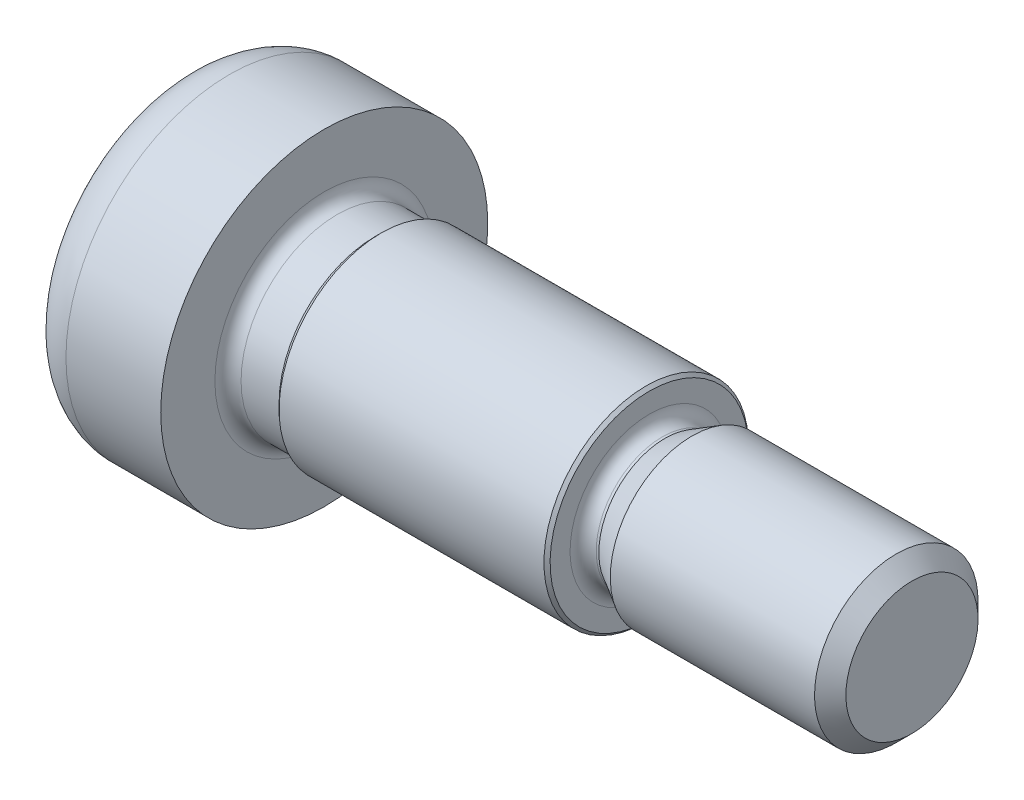
ISO-10303-21;
HEADER;
FILE_DESCRIPTION(('STEP AP214'),'2;1');
FILE_NAME('part.step','',(''),(''),'','','');
FILE_SCHEMA(('AUTOMOTIVE_DESIGN { 1 0 10303 214 1 1 1 1 }'));
ENDSEC;
DATA;
#1=APPLICATION_CONTEXT('core data for automotive mechanical design processes');
#2=APPLICATION_PROTOCOL_DEFINITION('international standard','automotive_design',2000,#1);
#3=PRODUCT_CONTEXT('',#1,'mechanical');
#4=PRODUCT('Part','Part','',(#3));
#5=PRODUCT_RELATED_PRODUCT_CATEGORY('part','',(#4));
#6=PRODUCT_DEFINITION_FORMATION('','',#4);
#7=PRODUCT_DEFINITION_CONTEXT('part definition',#1,'design');
#8=PRODUCT_DEFINITION('design','',#6,#7);
#9=PRODUCT_DEFINITION_SHAPE('','',#8);
#10=(LENGTH_UNIT() NAMED_UNIT(*) SI_UNIT(.MILLI.,.METRE.));
#11=(NAMED_UNIT(*) PLANE_ANGLE_UNIT() SI_UNIT($,.RADIAN.));
#12=(NAMED_UNIT(*) SI_UNIT($,.STERADIAN.) SOLID_ANGLE_UNIT());
#13=UNCERTAINTY_MEASURE_WITH_UNIT(LENGTH_MEASURE(1.E-05),#10,'distance_accuracy_value','');
#14=(GEOMETRIC_REPRESENTATION_CONTEXT(3) GLOBAL_UNCERTAINTY_ASSIGNED_CONTEXT((#13)) GLOBAL_UNIT_ASSIGNED_CONTEXT((#10,
#11,#12)) REPRESENTATION_CONTEXT('',''));
#15=CARTESIAN_POINT('',(0.,0.,0.));
#16=DIRECTION('',(0.,0.,1.));
#17=DIRECTION('',(1.,0.,0.));
#18=AXIS2_PLACEMENT_3D('',#15,#16,#17);
#19=CARTESIAN_POINT('',(-2.80999999989717,0.,0.));
#20=DIRECTION('',(-1.,0.,0.));
#21=DIRECTION('',(0.,0.,1.));
#22=AXIS2_PLACEMENT_3D('',#19,#20,#21);
#23=CONICAL_SURFACE('',#22,2.9040718539477,1.04719755119609);
#24=CARTESIAN_POINT('',(-1.13333333331411,1.13686837721616E-10,0.));
#25=VERTEX_POINT('',#24);
#26=VERTEX_LOOP('',#25);
#27=FACE_BOUND('',#26,.T.);
#28=CARTESIAN_POINT('',(-2.79999999995221,1.44337567298786,-2.49999999998912));
#29=CARTESIAN_POINT('',(-2.76336943135569,1.31652043413049,-2.49999999999609));
#30=CARTESIAN_POINT('',(-2.73005584632032,1.18857018265532,-2.49999999999895));
#31=CARTESIAN_POINT('',(-2.67190798419303,0.930454306688463,-2.50000000000105));
#32=CARTESIAN_POINT('',(-2.6470942753653,0.800284097470101,-2.50000000000028));
#33=CARTESIAN_POINT('',(-2.60846994862478,0.541556813183558,-2.49999999999973));
#34=CARTESIAN_POINT('',(-2.59440223443783,0.413039535473005,-2.49999999999993));
#35=CARTESIAN_POINT('',(-2.57761146010408,0.155400579290812,-2.50000000000007));
#36=CARTESIAN_POINT('',(-2.57487449240858,0.0262798366241759,-2.50000000000002));
#37=CARTESIAN_POINT('',(-2.5805828626341,-0.214968419309952,-2.49999999999998));
#38=CARTESIAN_POINT('',(-2.58762660646096,-0.32713213384364,-2.49999999999999));
#39=CARTESIAN_POINT('',(-2.60994662583864,-0.550728852897912,-2.5));
#40=CARTESIAN_POINT('',(-2.62523051840205,-0.662161084634378,-2.5));
#41=CARTESIAN_POINT('',(-2.66343729161492,-0.886218434016785,-2.5));
#42=CARTESIAN_POINT('',(-2.68652205271541,-0.998815208486799,-2.5));
#43=CARTESIAN_POINT('',(-2.73891470099291,-1.22232986225294,-2.5));
#44=CARTESIAN_POINT('',(-2.76821028588466,-1.33325060282122,-2.5));
#45=CARTESIAN_POINT('',(-2.79999999994514,-1.44337567298802,-2.5));
#46=B_SPLINE_CURVE_WITH_KNOTS('',3,(#28,#29,#30,#31,#32,#33,#34,#35,#36,#37,#38,#39,#40,#41,#42,
#43,#44,#45),.UNSPECIFIED.,.F.,.F.,(4,2,2,2,2,2,2,2,4),(0.,0.396270014449122,0.793492271289814,
1.18088450769943,1.56780111113299,1.90463472830536,2.24178024226325,2.58640202813631,
2.93034746692445),.UNSPECIFIED.);
#47=CARTESIAN_POINT('',(-2.79999999994564,1.44337567297799,-2.5000000000068));
#48=VERTEX_POINT('',#47);
#49=CARTESIAN_POINT('',(-2.79999999994564,-1.44337567297798,-2.50000000000679));
#50=VERTEX_POINT('',#49);
#51=EDGE_CURVE('E106',#48,#50,#46,.T.);
#52=ORIENTED_EDGE('',*,*,#51,.T.);
#53=CARTESIAN_POINT('',(-2.79999999995222,-1.44337567295774,-2.5000000000065));
#54=CARTESIAN_POINT('',(-2.76336943135569,-1.50680329239246,-2.39014014055637));
#55=CARTESIAN_POINT('',(-2.73005584632032,-1.57077841813252,-2.27933197235969));
#56=CARTESIAN_POINT('',(-2.67190798419303,-1.69983635611777,-2.05579706665337));
#57=CARTESIAN_POINT('',(-2.64709427536529,-1.76492146072628,-1.94306635865395));
#58=CARTESIAN_POINT('',(-2.60846994862478,-1.89428510286908,-1.71900195780937));
#59=CARTESIAN_POINT('',(-2.59440223443783,-1.95854374172453,-1.60770273048691));
#60=CARTESIAN_POINT('',(-2.57761146010408,-2.08736321981575,-1.3845808494287));
#61=CARTESIAN_POINT('',(-2.57487449240858,-2.15192359114902,-1.27275900612385));
#62=CARTESIAN_POINT('',(-2.5805828626341,-2.27254771911605,-1.06383188786619));
#63=CARTESIAN_POINT('',(-2.58762660646095,-2.32862957638291,-0.966695261697194));
#64=CARTESIAN_POINT('',(-2.60994662583863,-2.44042793591005,-0.773054822793345));
#65=CARTESIAN_POINT('',(-2.62523051840205,-2.49614405177828,-0.676551679309169));
#66=CARTESIAN_POINT('',(-2.66343729161492,-2.60817272646949,-0.482512322839397));
#67=CARTESIAN_POINT('',(-2.68652205271541,-2.66447111370449,-0.385000655764178));
#68=CARTESIAN_POINT('',(-2.73891470099291,-2.77622844058757,-0.191431287484617));
#69=CARTESIAN_POINT('',(-2.76821028588466,-2.83168881087171,-0.0953711083458992));
#70=CARTESIAN_POINT('',(-2.79999999994514,-2.88675134595511,1.20937300864769E-11));
#71=B_SPLINE_CURVE_WITH_KNOTS('',3,(#53,#54,#55,#56,#57,#58,#59,#60,#61,#62,#63,#64,#65,#66,#67,
#68,#69,#70),.UNSPECIFIED.,.F.,.F.,(4,2,2,2,2,2,2,2,4),(0.,0.396270014449122,0.793492271289814,
1.18088450769943,1.56780111113299,1.90463472830536,2.24178024226325,2.58640202813632,
2.93034746692446),.UNSPECIFIED.);
#72=CARTESIAN_POINT('',(-2.79999999994564,-2.88675134595597,0.));
#73=VERTEX_POINT('',#72);
#74=EDGE_CURVE('E109',#50,#73,#71,.T.);
#75=ORIENTED_EDGE('',*,*,#74,.T.);
#76=CARTESIAN_POINT('',(-2.79999999995222,-2.8867513459456,-1.73849766311451E-11));
#77=CARTESIAN_POINT('',(-2.76336943135569,-2.82332372652296,0.109859859439725));
#78=CARTESIAN_POINT('',(-2.73005584632032,-2.75934860078785,0.220668027639261));
#79=CARTESIAN_POINT('',(-2.67190798419304,-2.63029066280624,0.444202933347681));
#80=CARTESIAN_POINT('',(-2.6470942753653,-2.56520555819639,0.556933641346332));
#81=CARTESIAN_POINT('',(-2.60846994862479,-2.43584191605264,0.780998042190361));
#82=CARTESIAN_POINT('',(-2.59440223443783,-2.37158327719754,0.89229726951302));
#83=CARTESIAN_POINT('',(-2.57761146010408,-2.24276379910657,1.11541915057138));
#84=CARTESIAN_POINT('',(-2.57487449240858,-2.1782034277732,1.22724099387617));
#85=CARTESIAN_POINT('',(-2.5805828626341,-2.05757929980611,1.4361681121338));
#86=CARTESIAN_POINT('',(-2.58762660646096,-2.00149744253927,1.5333047383028));
#87=CARTESIAN_POINT('',(-2.60994662583864,-1.88969908301214,1.72694517720666));
#88=CARTESIAN_POINT('',(-2.62523051840206,-1.83398296714391,1.82344832069083));
#89=CARTESIAN_POINT('',(-2.66343729161493,-1.7219542924527,2.0174876771606));
#90=CARTESIAN_POINT('',(-2.68652205271541,-1.6656559052177,2.11499934423582));
#91=CARTESIAN_POINT('',(-2.73891470099292,-1.55389857833463,2.30856871251538));
#92=CARTESIAN_POINT('',(-2.76821028588467,-1.49843820805048,2.4046288916541));
#93=CARTESIAN_POINT('',(-2.79999999994514,-1.44337567296708,2.50000000001209));
#94=B_SPLINE_CURVE_WITH_KNOTS('',3,(#76,#77,#78,#79,#80,#81,#82,#83,#84,#85,#86,#87,#88,#89,#90,
#91,#92,#93),.UNSPECIFIED.,.F.,.F.,(4,2,2,2,2,2,2,2,4),(0.,0.396270014449122,0.793492271289814,
1.18088450769944,1.56780111113299,1.90463472830536,2.24178024226325,2.58640202813631,
2.93034746692445),.UNSPECIFIED.);
#95=CARTESIAN_POINT('',(-2.79999999994564,-1.44337567297799,2.5000000000068));
#96=VERTEX_POINT('',#95);
#97=EDGE_CURVE('E136',#73,#96,#94,.T.);
#98=ORIENTED_EDGE('',*,*,#97,.T.);
#99=CARTESIAN_POINT('',(-2.79999999995221,-1.44337567298786,2.49999999998912));
#100=CARTESIAN_POINT('',(-2.76336943135569,-1.31652043413049,2.49999999999609));
#101=CARTESIAN_POINT('',(-2.73005584632032,-1.18857018265532,2.49999999999895));
#102=CARTESIAN_POINT('',(-2.67190798419303,-0.930454306688462,2.50000000000105));
#103=CARTESIAN_POINT('',(-2.6470942753653,-0.8002840974701,2.50000000000028));
#104=CARTESIAN_POINT('',(-2.60846994862478,-0.541556813183558,2.49999999999973));
#105=CARTESIAN_POINT('',(-2.59440223443783,-0.413039535473004,2.49999999999993));
#106=CARTESIAN_POINT('',(-2.57761146010408,-0.155400579290811,2.50000000000007));
#107=CARTESIAN_POINT('',(-2.57487449240858,-0.0262798366241754,2.50000000000002));
#108=CARTESIAN_POINT('',(-2.5805828626341,0.214968419309952,2.49999999999998));
#109=CARTESIAN_POINT('',(-2.58762660646096,0.327132133843641,2.5));
#110=CARTESIAN_POINT('',(-2.60994662583864,0.550728852897913,2.5));
#111=CARTESIAN_POINT('',(-2.62523051840205,0.662161084634379,2.5));
#112=CARTESIAN_POINT('',(-2.66343729161493,0.886218434016785,2.5));
#113=CARTESIAN_POINT('',(-2.68652205271541,0.9988152084868,2.5));
#114=CARTESIAN_POINT('',(-2.73891470099291,1.22232986225294,2.5));
#115=CARTESIAN_POINT('',(-2.76821028588466,1.33325060282122,2.5));
#116=CARTESIAN_POINT('',(-2.79999999994514,1.44337567298802,2.5));
#117=B_SPLINE_CURVE_WITH_KNOTS('',3,(#99,#100,#101,#102,#103,#104,#105,#106,#107,#108,#109,#110,
#111,#112,#113,#114,#115,#116),.UNSPECIFIED.,.F.,.F.,(4,2,2,2,2,2,2,2,4),(0.,0.396270014449122,
0.793492271289814,1.18088450769943,1.56780111113299,1.90463472830536,2.24178024226325,
2.58640202813631,2.93034746692445),.UNSPECIFIED.);
#118=CARTESIAN_POINT('',(-2.79999999994564,1.44337567297798,2.5000000000068));
#119=VERTEX_POINT('',#118);
#120=EDGE_CURVE('E142',#96,#119,#117,.T.);
#121=ORIENTED_EDGE('',*,*,#120,.T.);
#122=CARTESIAN_POINT('',(-2.79999999995221,1.44337567295774,2.5000000000065));
#123=CARTESIAN_POINT('',(-2.76336943135569,1.50680329239246,2.39014014055637));
#124=CARTESIAN_POINT('',(-2.73005584632032,1.57077841813252,2.27933197235969));
#125=CARTESIAN_POINT('',(-2.67190798419303,1.69983635611777,2.05579706665337));
#126=CARTESIAN_POINT('',(-2.64709427536529,1.76492146072628,1.94306635865395));
#127=CARTESIAN_POINT('',(-2.60846994862478,1.89428510286908,1.71900195780937));
#128=CARTESIAN_POINT('',(-2.59440223443783,1.95854374172453,1.60770273048691));
#129=CARTESIAN_POINT('',(-2.57761146010408,2.08736321981575,1.3845808494287));
#130=CARTESIAN_POINT('',(-2.57487449240858,2.15192359114902,1.27275900612385));
#131=CARTESIAN_POINT('',(-2.58058286263409,2.27254771911605,1.06383188786619));
#132=CARTESIAN_POINT('',(-2.58762660646095,2.32862957638291,0.966695261697194));
#133=CARTESIAN_POINT('',(-2.60994662583863,2.44042793591005,0.773054822793345));
#134=CARTESIAN_POINT('',(-2.62523051840205,2.49614405177828,0.676551679309169));
#135=CARTESIAN_POINT('',(-2.66343729161492,2.60817272646949,0.482512322839397));
#136=CARTESIAN_POINT('',(-2.68652205271541,2.66447111370449,0.385000655764177));
#137=CARTESIAN_POINT('',(-2.73891470099291,2.77622844058757,0.191431287484617));
#138=CARTESIAN_POINT('',(-2.76821028588466,2.83168881087171,0.0953711083458985));
#139=CARTESIAN_POINT('',(-2.79999999994514,2.88675134595511,-1.20943108200643E-11));
#140=B_SPLINE_CURVE_WITH_KNOTS('',3,(#122,#123,#124,#125,#126,#127,#128,#129,#130,#131,#132,
#133,#134,#135,#136,#137,#138,#139),.UNSPECIFIED.,.F.,.F.,(4,2,2,2,2,2,2,2,4),(0.,
0.396270014449122,0.793492271289814,1.18088450769943,1.56780111113299,1.90463472830536,
2.24178024226325,2.58640202813632,2.93034746692446),.UNSPECIFIED.);
#141=CARTESIAN_POINT('',(-2.79999999994337,2.88675134595205,-6.79639141308692E-12));
#142=VERTEX_POINT('',#141);
#143=EDGE_CURVE('E94',#119,#142,#140,.T.);
#144=ORIENTED_EDGE('',*,*,#143,.T.);
#145=CARTESIAN_POINT('',(-2.79999999995222,2.8867513459456,1.73856786329555E-11));
#146=CARTESIAN_POINT('',(-2.76336943135569,2.82332372652296,-0.109859859439724));
#147=CARTESIAN_POINT('',(-2.73005584632032,2.75934860078785,-0.22066802763926));
#148=CARTESIAN_POINT('',(-2.67190798419303,2.63029066280624,-0.44420293334768));
#149=CARTESIAN_POINT('',(-2.6470942753653,2.56520555819639,-0.556933641346331));
#150=CARTESIAN_POINT('',(-2.60846994862478,2.43584191605264,-0.780998042190361));
#151=CARTESIAN_POINT('',(-2.59440223443783,2.37158327719754,-0.892297269513019));
#152=CARTESIAN_POINT('',(-2.57761146010408,2.24276379910657,-1.11541915057138));
#153=CARTESIAN_POINT('',(-2.57487449240858,2.1782034277732,-1.22724099387617));
#154=CARTESIAN_POINT('',(-2.5805828626341,2.05757929980611,-1.4361681121338));
#155=CARTESIAN_POINT('',(-2.58762660646096,2.00149744253927,-1.5333047383028));
#156=CARTESIAN_POINT('',(-2.60994662583864,1.88969908301214,-1.72694517720666));
#157=CARTESIAN_POINT('',(-2.62523051840205,1.83398296714391,-1.82344832069083));
#158=CARTESIAN_POINT('',(-2.66343729161493,1.7219542924527,-2.0174876771606));
#159=CARTESIAN_POINT('',(-2.68652205271541,1.6656559052177,-2.11499934423582));
#160=CARTESIAN_POINT('',(-2.73891470099292,1.55389857833463,-2.30856871251538));
#161=CARTESIAN_POINT('',(-2.76821028588467,1.49843820805048,-2.4046288916541));
#162=CARTESIAN_POINT('',(-2.79999999994514,1.44337567296708,-2.50000000001209));
#163=B_SPLINE_CURVE_WITH_KNOTS('',3,(#145,#146,#147,#148,#149,#150,#151,#152,#153,#154,#155,
#156,#157,#158,#159,#160,#161,#162),.UNSPECIFIED.,.F.,.F.,(4,2,2,2,2,2,2,2,4),(0.,
0.396270014449122,0.793492271289814,1.18088450769943,1.56780111113299,1.90463472830536,
2.24178024226325,2.58640202813631,2.93034746692445),.UNSPECIFIED.);
#164=EDGE_CURVE('E112',#142,#48,#163,.T.);
#165=ORIENTED_EDGE('',*,*,#164,.T.);
#166=EDGE_LOOP('',(#52,#75,#98,#121,#144,#165));
#167=FACE_BOUND('',#166,.T.);
#168=ADVANCED_FACE('F44',(#27,#167),#23,.F.);
#169=CARTESIAN_POINT('',(-7.,1.44337567297406,2.5));
#170=DIRECTION('',(0.,0.866025403784439,0.5));
#171=DIRECTION('',(0.,-0.5,0.866025403784439));
#172=AXIS2_PLACEMENT_3D('',#169,#170,#171);
#173=PLANE('',#172);
#174=DIRECTION('',(1.,0.,0.));
#175=VECTOR('',#174,1.);
#176=CARTESIAN_POINT('',(-7.,1.44337567297406,2.5));
#177=LINE('',#176,#175);
#178=CARTESIAN_POINT('',(-7.,1.44337567297406,2.5));
#179=VERTEX_POINT('',#178);
#180=EDGE_CURVE('E145',#119,#179,#177,.F.);
#181=ORIENTED_EDGE('',*,*,#180,.T.);
#182=DIRECTION('',(0.,-0.500000000000001,0.866025403784438));
#183=VECTOR('',#182,1.);
#184=CARTESIAN_POINT('',(-7.,2.88675134594813,0.));
#185=LINE('',#184,#183);
#186=CARTESIAN_POINT('',(-7.,2.88675134594813,0.));
#187=VERTEX_POINT('',#186);
#188=EDGE_CURVE('E150',#187,#179,#185,.T.);
#189=ORIENTED_EDGE('',*,*,#188,.F.);
#190=DIRECTION('',(1.,0.,0.));
#191=VECTOR('',#190,1.);
#192=CARTESIAN_POINT('',(-7.,2.88675134594813,0.));
#193=LINE('',#192,#191);
#194=EDGE_CURVE('E303',#187,#142,#193,.T.);
#195=ORIENTED_EDGE('',*,*,#194,.T.);
#196=ORIENTED_EDGE('',*,*,#143,.F.);
#197=EDGE_LOOP('',(#181,#189,#195,#196));
#198=FACE_BOUND('',#197,.T.);
#199=ADVANCED_FACE('F100',(#198),#173,.F.);
#200=CARTESIAN_POINT('',(-7.,-1.44337567297406,2.5));
#201=DIRECTION('',(0.,0.,1.));
#202=DIRECTION('',(0.,-1.,0.));
#203=AXIS2_PLACEMENT_3D('',#200,#201,#202);
#204=PLANE('',#203);
#205=DIRECTION('',(1.,0.,0.));
#206=VECTOR('',#205,1.);
#207=CARTESIAN_POINT('',(-7.,-1.44337567297406,2.5));
#208=LINE('',#207,#206);
#209=CARTESIAN_POINT('',(-7.,-1.44337567297406,2.5));
#210=VERTEX_POINT('',#209);
#211=EDGE_CURVE('E139',#96,#210,#208,.F.);
#212=ORIENTED_EDGE('',*,*,#211,.T.);
#213=DIRECTION('',(0.,-1.,0.));
#214=VECTOR('',#213,1.);
#215=CARTESIAN_POINT('',(-7.,5.44337567297406,2.5));
#216=LINE('',#215,#214);
#217=EDGE_CURVE('E154',#179,#210,#216,.T.);
#218=ORIENTED_EDGE('',*,*,#217,.F.);
#219=ORIENTED_EDGE('',*,*,#180,.F.);
#220=ORIENTED_EDGE('',*,*,#120,.F.);
#221=EDGE_LOOP('',(#212,#218,#219,#220));
#222=FACE_BOUND('',#221,.T.);
#223=ADVANCED_FACE('F274',(#222),#204,.F.);
#224=CARTESIAN_POINT('',(-7.,-2.88675134594813,0.));
#225=DIRECTION('',(0.,-0.866025403784439,0.5));
#226=DIRECTION('',(0.,-0.5,-0.866025403784439));
#227=AXIS2_PLACEMENT_3D('',#224,#225,#226);
#228=PLANE('',#227);
#229=DIRECTION('',(1.,0.,0.));
#230=VECTOR('',#229,1.);
#231=CARTESIAN_POINT('',(-7.,-2.88675134594813,0.));
#232=LINE('',#231,#230);
#233=CARTESIAN_POINT('',(-7.,-2.88675134594813,0.));
#234=VERTEX_POINT('',#233);
#235=EDGE_CURVE('E126',#73,#234,#232,.F.);
#236=ORIENTED_EDGE('',*,*,#235,.T.);
#237=DIRECTION('',(0.,-0.500000000000001,-0.866025403784438));
#238=VECTOR('',#237,1.);
#239=CARTESIAN_POINT('',(-7.,-1.44337567297406,2.5));
#240=LINE('',#239,#238);
#241=EDGE_CURVE('E288',#210,#234,#240,.T.);
#242=ORIENTED_EDGE('',*,*,#241,.F.);
#243=ORIENTED_EDGE('',*,*,#211,.F.);
#244=ORIENTED_EDGE('',*,*,#97,.F.);
#245=EDGE_LOOP('',(#236,#242,#243,#244));
#246=FACE_BOUND('',#245,.T.);
#247=ADVANCED_FACE('F271',(#246),#228,.F.);
#248=CARTESIAN_POINT('',(-7.,-1.44337567297406,-2.5));
#249=DIRECTION('',(0.,-0.866025403784439,-0.5));
#250=DIRECTION('',(0.,0.5,-0.866025403784439));
#251=AXIS2_PLACEMENT_3D('',#248,#249,#250);
#252=PLANE('',#251);
#253=DIRECTION('',(1.,0.,0.));
#254=VECTOR('',#253,1.);
#255=CARTESIAN_POINT('',(-7.,-1.44337567297406,-2.5));
#256=LINE('',#255,#254);
#257=CARTESIAN_POINT('',(-7.,-1.44337567297406,-2.5));
#258=VERTEX_POINT('',#257);
#259=EDGE_CURVE('E114',#50,#258,#256,.F.);
#260=ORIENTED_EDGE('',*,*,#259,.T.);
#261=DIRECTION('',(0.,0.500000000000001,-0.866025403784438));
#262=VECTOR('',#261,1.);
#263=CARTESIAN_POINT('',(-7.,-2.88675134594813,0.));
#264=LINE('',#263,#262);
#265=EDGE_CURVE('E291',#234,#258,#264,.T.);
#266=ORIENTED_EDGE('',*,*,#265,.F.);
#267=ORIENTED_EDGE('',*,*,#235,.F.);
#268=ORIENTED_EDGE('',*,*,#74,.F.);
#269=EDGE_LOOP('',(#260,#266,#267,#268));
#270=FACE_BOUND('',#269,.T.);
#271=ADVANCED_FACE('F235',(#270),#252,.F.);
#272=CARTESIAN_POINT('',(-7.,1.44337567297406,-2.5));
#273=DIRECTION('',(0.,0.,-1.));
#274=DIRECTION('',(0.,1.,0.));
#275=AXIS2_PLACEMENT_3D('',#272,#273,#274);
#276=PLANE('',#275);
#277=DIRECTION('',(1.,0.,0.));
#278=VECTOR('',#277,1.);
#279=CARTESIAN_POINT('',(-7.,1.44337567297406,-2.5));
#280=LINE('',#279,#278);
#281=CARTESIAN_POINT('',(-7.,1.44337567297406,-2.5));
#282=VERTEX_POINT('',#281);
#283=EDGE_CURVE('E61',#48,#282,#280,.F.);
#284=ORIENTED_EDGE('',*,*,#283,.T.);
#285=DIRECTION('',(0.,-1.,0.));
#286=VECTOR('',#285,1.);
#287=CARTESIAN_POINT('',(-7.,5.44337567297406,-2.5));
#288=LINE('',#287,#286);
#289=EDGE_CURVE('E118',#258,#282,#288,.F.);
#290=ORIENTED_EDGE('',*,*,#289,.F.);
#291=ORIENTED_EDGE('',*,*,#259,.F.);
#292=ORIENTED_EDGE('',*,*,#51,.F.);
#293=EDGE_LOOP('',(#284,#290,#291,#292));
#294=FACE_BOUND('',#293,.T.);
#295=ADVANCED_FACE('F116',(#294),#276,.F.);
#296=CARTESIAN_POINT('',(-7.,2.88675134594813,0.));
#297=DIRECTION('',(0.,0.866025403784439,-0.5));
#298=DIRECTION('',(0.,0.5,0.866025403784439));
#299=AXIS2_PLACEMENT_3D('',#296,#297,#298);
#300=PLANE('',#299);
#301=ORIENTED_EDGE('',*,*,#194,.F.);
#302=DIRECTION('',(0.,0.500000000000001,0.866025403784438));
#303=VECTOR('',#302,1.);
#304=CARTESIAN_POINT('',(-7.,1.44337567297406,-2.5));
#305=LINE('',#304,#303);
#306=EDGE_CURVE('E157',#282,#187,#305,.T.);
#307=ORIENTED_EDGE('',*,*,#306,.F.);
#308=ORIENTED_EDGE('',*,*,#283,.F.);
#309=ORIENTED_EDGE('',*,*,#164,.F.);
#310=EDGE_LOOP('',(#301,#307,#308,#309));
#311=FACE_BOUND('',#310,.T.);
#312=ADVANCED_FACE('F226',(#311),#300,.F.);
#313=CARTESIAN_POINT('',(-7.,5.44337567297406,0.));
#314=DIRECTION('',(-1.,0.,0.));
#315=DIRECTION('',(0.,-1.,0.));
#316=AXIS2_PLACEMENT_3D('',#313,#314,#315);
#317=PLANE('',#316);
#318=CARTESIAN_POINT('',(-7.,0.,0.));
#319=DIRECTION('',(-1.,0.,0.));
#320=DIRECTION('',(0.,-1.,0.));
#321=AXIS2_PLACEMENT_3D('',#318,#319,#320);
#322=CIRCLE('',#321,5.6378);
#323=CARTESIAN_POINT('',(-7.,-5.6378,0.));
#324=VERTEX_POINT('',#323);
#325=EDGE_CURVE('E13',#324,#324,#322,.T.);
#326=ORIENTED_EDGE('',*,*,#325,.T.);
#327=EDGE_LOOP('',(#326));
#328=FACE_BOUND('',#327,.T.);
#329=ORIENTED_EDGE('',*,*,#289,.T.);
#330=ORIENTED_EDGE('',*,*,#306,.T.);
#331=ORIENTED_EDGE('',*,*,#188,.T.);
#332=ORIENTED_EDGE('',*,*,#217,.T.);
#333=ORIENTED_EDGE('',*,*,#241,.T.);
#334=ORIENTED_EDGE('',*,*,#265,.T.);
#335=EDGE_LOOP('',(#329,#330,#331,#332,#333,#334));
#336=FACE_BOUND('',#335,.T.);
#337=ADVANCED_FACE('F223',(#328,#336),#317,.T.);
#338=CARTESIAN_POINT('',(-3.5,0.,0.));
#339=DIRECTION('',(1.,0.,0.));
#340=DIRECTION('',(0.,1.,0.));
#341=AXIS2_PLACEMENT_3D('',#338,#339,#340);
#342=CYLINDRICAL_SURFACE('',#341,8.);
#343=CARTESIAN_POINT('',(-4.6378,0.,0.));
#344=DIRECTION('',(-1.,0.,0.));
#345=DIRECTION('',(0.,-1.,0.));
#346=AXIS2_PLACEMENT_3D('',#343,#344,#345);
#347=CIRCLE('',#346,8.);
#348=CARTESIAN_POINT('',(-4.6378,-8.,0.));
#349=VERTEX_POINT('',#348);
#350=EDGE_CURVE('E53',#349,#349,#347,.F.);
#351=ORIENTED_EDGE('',*,*,#350,.T.);
#352=EDGE_LOOP('',(#351));
#353=FACE_BOUND('',#352,.T.);
#354=CARTESIAN_POINT('',(0.,0.,0.));
#355=DIRECTION('',(1.,0.,0.));
#356=DIRECTION('',(0.,1.,0.));
#357=AXIS2_PLACEMENT_3D('',#354,#355,#356);
#358=CIRCLE('',#357,8.);
#359=CARTESIAN_POINT('',(0.,8.,0.));
#360=VERTEX_POINT('',#359);
#361=EDGE_CURVE('E170',#360,#360,#358,.T.);
#362=ORIENTED_EDGE('',*,*,#361,.F.);
#363=EDGE_LOOP('',(#362));
#364=FACE_BOUND('',#363,.T.);
#365=ADVANCED_FACE('F218',(#353,#364),#342,.T.);
#366=CARTESIAN_POINT('',(0.,6.5,0.));
#367=DIRECTION('',(1.,0.,0.));
#368=DIRECTION('',(0.,1.,0.));
#369=AXIS2_PLACEMENT_3D('',#366,#367,#368);
#370=PLANE('',#369);
#371=CARTESIAN_POINT('',(0.,0.,0.));
#372=DIRECTION('',(1.,0.,0.));
#373=DIRECTION('',(0.,1.,0.));
#374=AXIS2_PLACEMENT_3D('',#371,#372,#373);
#375=CIRCLE('',#374,5.35);
#376=CARTESIAN_POINT('',(0.,5.35,0.));
#377=VERTEX_POINT('',#376);
#378=EDGE_CURVE('E367',#377,#377,#375,.F.);
#379=ORIENTED_EDGE('',*,*,#378,.T.);
#380=EDGE_LOOP('',(#379));
#381=FACE_BOUND('',#380,.T.);
#382=ORIENTED_EDGE('',*,*,#361,.T.);
#383=EDGE_LOOP('',(#382));
#384=FACE_BOUND('',#383,.T.);
#385=ADVANCED_FACE('F208',(#381,#384),#370,.T.);
#386=CARTESIAN_POINT('',(2.49999999999772,0.,0.));
#387=DIRECTION('',(-1.,0.,0.));
#388=DIRECTION('',(0.,-1.,0.));
#389=AXIS2_PLACEMENT_3D('',#386,#387,#388);
#390=CYLINDRICAL_SURFACE('',#389,4.71);
#391=CARTESIAN_POINT('',(0.640000000000003,0.,0.));
#392=DIRECTION('',(1.,0.,0.));
#393=DIRECTION('',(0.,1.,0.));
#394=AXIS2_PLACEMENT_3D('',#391,#392,#393);
#395=CIRCLE('',#394,4.71);
#396=CARTESIAN_POINT('',(0.640000000000003,4.71,0.));
#397=VERTEX_POINT('',#396);
#398=EDGE_CURVE('E365',#397,#397,#395,.T.);
#399=ORIENTED_EDGE('',*,*,#398,.T.);
#400=EDGE_LOOP('',(#399));
#401=FACE_BOUND('',#400,.T.);
#402=CARTESIAN_POINT('',(2.49999999999772,0.,0.));
#403=DIRECTION('',(1.,0.,0.));
#404=DIRECTION('',(0.,1.,0.));
#405=AXIS2_PLACEMENT_3D('',#402,#403,#404);
#406=CIRCLE('',#405,4.71);
#407=CARTESIAN_POINT('',(2.49999999999772,4.71,0.));
#408=VERTEX_POINT('',#407);
#409=EDGE_CURVE('E312',#408,#408,#406,.T.);
#410=ORIENTED_EDGE('',*,*,#409,.F.);
#411=EDGE_LOOP('',(#410));
#412=FACE_BOUND('',#411,.T.);
#413=ADVANCED_FACE('F102',(#401,#412),#390,.T.);
#414=CARTESIAN_POINT('',(2.49999999999772,0.,0.));
#415=DIRECTION('',(1.,0.,0.));
#416=DIRECTION('',(0.,1.,0.));
#417=AXIS2_PLACEMENT_3D('',#414,#415,#416);
#418=CONICAL_SURFACE('',#417,4.71000000004551,0.785398163397452);
#419=CARTESIAN_POINT('',(2.79,0.,0.));
#420=DIRECTION('',(1.,0.,0.));
#421=DIRECTION('',(0.,1.,0.));
#422=AXIS2_PLACEMENT_3D('',#419,#420,#421);
#423=CIRCLE('',#422,5.00000000004779);
#424=CARTESIAN_POINT('',(2.79,5.00000000004779,0.));
#425=VERTEX_POINT('',#424);
#426=EDGE_CURVE('E315',#425,#425,#423,.T.);
#427=ORIENTED_EDGE('',*,*,#426,.F.);
#428=EDGE_LOOP('',(#427));
#429=FACE_BOUND('',#428,.T.);
#430=ORIENTED_EDGE('',*,*,#409,.T.);
#431=EDGE_LOOP('',(#430));
#432=FACE_BOUND('',#431,.T.);
#433=ADVANCED_FACE('F348',(#429,#432),#418,.T.);
#434=CARTESIAN_POINT('',(15.9,0.,0.));
#435=DIRECTION('',(-1.,0.,0.));
#436=DIRECTION('',(0.,-1.,0.));
#437=AXIS2_PLACEMENT_3D('',#434,#435,#436);
#438=CYLINDRICAL_SURFACE('',#437,5.);
#439=CARTESIAN_POINT('',(15.7499999999734,0.,0.));
#440=DIRECTION('',(1.,0.,0.));
#441=DIRECTION('',(0.,1.,0.));
#442=AXIS2_PLACEMENT_3D('',#439,#440,#441);
#443=CIRCLE('',#442,5.);
#444=CARTESIAN_POINT('',(15.7499999999734,5.,0.));
#445=VERTEX_POINT('',#444);
#446=EDGE_CURVE('E406',#445,#445,#443,.F.);
#447=ORIENTED_EDGE('',*,*,#446,.T.);
#448=EDGE_LOOP('',(#447));
#449=FACE_BOUND('',#448,.T.);
#450=ORIENTED_EDGE('',*,*,#426,.T.);
#451=EDGE_LOOP('',(#450));
#452=FACE_BOUND('',#451,.T.);
#453=ADVANCED_FACE('F341',(#449,#452),#438,.T.);
#454=CARTESIAN_POINT('',(15.9,0.,0.));
#455=DIRECTION('',(1.,0.,0.));
#456=DIRECTION('',(0.,1.,0.));
#457=AXIS2_PLACEMENT_3D('',#454,#455,#456);
#458=PLANE('',#457);
#459=CARTESIAN_POINT('',(15.9,0.,0.));
#460=DIRECTION('',(1.,0.,0.));
#461=DIRECTION('',(0.,1.,0.));
#462=AXIS2_PLACEMENT_3D('',#459,#460,#461);
#463=CIRCLE('',#462,3.87318749999999);
#464=CARTESIAN_POINT('',(15.9,3.87318749999999,0.));
#465=VERTEX_POINT('',#464);
#466=EDGE_CURVE('E368',#465,#465,#463,.F.);
#467=ORIENTED_EDGE('',*,*,#466,.T.);
#468=EDGE_LOOP('',(#467));
#469=FACE_BOUND('',#468,.T.);
#470=CARTESIAN_POINT('',(15.9,0.,0.));
#471=DIRECTION('',(1.,0.,0.));
#472=DIRECTION('',(0.,1.,0.));
#473=AXIS2_PLACEMENT_3D('',#470,#471,#472);
#474=CIRCLE('',#473,4.85000000003021);
#475=CARTESIAN_POINT('',(15.9,4.85000000003021,0.));
#476=VERTEX_POINT('',#475);
#477=EDGE_CURVE('E409',#476,#476,#474,.T.);
#478=ORIENTED_EDGE('',*,*,#477,.T.);
#479=EDGE_LOOP('',(#478));
#480=FACE_BOUND('',#479,.T.);
#481=ADVANCED_FACE('F335',(#469,#480),#458,.T.);
#482=CARTESIAN_POINT('',(16.6668125,0.,0.));
#483=DIRECTION('',(-1.,0.,0.));
#484=DIRECTION('',(0.,-1.,0.));
#485=AXIS2_PLACEMENT_3D('',#482,#483,#484);
#486=CYLINDRICAL_SURFACE('',#485,3.23318749999999);
#487=CARTESIAN_POINT('',(16.54,0.,0.));
#488=DIRECTION('',(1.,0.,0.));
#489=DIRECTION('',(0.,1.,0.));
#490=AXIS2_PLACEMENT_3D('',#487,#488,#489);
#491=CIRCLE('',#490,3.23318749999999);
#492=CARTESIAN_POINT('',(16.54,3.23318749999999,0.));
#493=VERTEX_POINT('',#492);
#494=EDGE_CURVE('E373',#493,#493,#491,.T.);
#495=ORIENTED_EDGE('',*,*,#494,.T.);
#496=EDGE_LOOP('',(#495));
#497=FACE_BOUND('',#496,.T.);
#498=CARTESIAN_POINT('',(16.6668125,0.,0.));
#499=DIRECTION('',(1.,0.,0.));
#500=DIRECTION('',(0.,1.,0.));
#501=AXIS2_PLACEMENT_3D('',#498,#499,#500);
#502=CIRCLE('',#501,3.23318749999999);
#503=CARTESIAN_POINT('',(16.6668125,3.23318749999999,0.));
#504=VERTEX_POINT('',#503);
#505=EDGE_CURVE('E318',#504,#504,#502,.T.);
#506=ORIENTED_EDGE('',*,*,#505,.F.);
#507=EDGE_LOOP('',(#506));
#508=FACE_BOUND('',#507,.T.);
#509=ADVANCED_FACE('F330',(#497,#508),#486,.T.);
#510=CARTESIAN_POINT('',(16.6668125,0.,0.));
#511=DIRECTION('',(1.,0.,0.));
#512=DIRECTION('',(0.,1.,0.));
#513=AXIS2_PLACEMENT_3D('',#510,#511,#512);
#514=CONICAL_SURFACE('',#513,3.23318749999448,0.523598775598712);
#515=CARTESIAN_POINT('',(17.9949707099203,0.,0.));
#516=DIRECTION('',(1.,0.,0.));
#517=DIRECTION('',(0.,1.,0.));
#518=AXIS2_PLACEMENT_3D('',#515,#516,#517);
#519=CIRCLE('',#518,4.00000000001911);
#520=CARTESIAN_POINT('',(17.9949707099203,4.00000000001911,0.));
#521=VERTEX_POINT('',#520);
#522=EDGE_CURVE('E321',#521,#521,#519,.T.);
#523=ORIENTED_EDGE('',*,*,#522,.F.);
#524=EDGE_LOOP('',(#523));
#525=FACE_BOUND('',#524,.T.);
#526=ORIENTED_EDGE('',*,*,#505,.T.);
#527=EDGE_LOOP('',(#526));
#528=FACE_BOUND('',#527,.T.);
#529=ADVANCED_FACE('F327',(#525,#528),#514,.T.);
#530=CARTESIAN_POINT('',(28.7549707099203,0.,0.));
#531=DIRECTION('',(-1.,0.,0.));
#532=DIRECTION('',(0.,-1.,0.));
#533=AXIS2_PLACEMENT_3D('',#530,#531,#532);
#534=CYLINDRICAL_SURFACE('',#533,4.);
#535=CARTESIAN_POINT('',(27.9881582099348,0.,0.));
#536=DIRECTION('',(1.,0.,0.));
#537=DIRECTION('',(0.,1.,0.));
#538=AXIS2_PLACEMENT_3D('',#535,#536,#537);
#539=CIRCLE('',#538,4.);
#540=CARTESIAN_POINT('',(27.9881582099348,4.,0.));
#541=VERTEX_POINT('',#540);
#542=EDGE_CURVE('E411',#541,#541,#539,.F.);
#543=ORIENTED_EDGE('',*,*,#542,.T.);
#544=EDGE_LOOP('',(#543));
#545=FACE_BOUND('',#544,.T.);
#546=ORIENTED_EDGE('',*,*,#522,.T.);
#547=EDGE_LOOP('',(#546));
#548=FACE_BOUND('',#547,.T.);
#549=ADVANCED_FACE('F325',(#545,#548),#534,.T.);
#550=CARTESIAN_POINT('',(28.7549707099203,0.,0.));
#551=DIRECTION('',(1.,0.,0.));
#552=DIRECTION('',(0.,1.,0.));
#553=AXIS2_PLACEMENT_3D('',#550,#551,#552);
#554=PLANE('',#553);
#555=CARTESIAN_POINT('',(28.7549707099203,0.,0.));
#556=DIRECTION('',(1.,0.,0.));
#557=DIRECTION('',(0.,1.,0.));
#558=AXIS2_PLACEMENT_3D('',#555,#556,#557);
#559=CIRCLE('',#558,3.2331875000714);
#560=CARTESIAN_POINT('',(28.7549707099203,3.2331875000714,0.));
#561=VERTEX_POINT('',#560);
#562=EDGE_CURVE('E176',#561,#561,#559,.T.);
#563=ORIENTED_EDGE('',*,*,#562,.T.);
#564=EDGE_LOOP('',(#563));
#565=FACE_BOUND('',#564,.T.);
#566=ADVANCED_FACE('F401',(#565),#554,.T.);
#567=CARTESIAN_POINT('',(28.7549707099203,0.,0.));
#568=DIRECTION('',(-1.,0.,0.));
#569=DIRECTION('',(0.,-1.,0.));
#570=AXIS2_PLACEMENT_3D('',#567,#568,#569);
#571=CONICAL_SURFACE('',#570,3.2331875000714,0.785398163360383);
#572=ORIENTED_EDGE('',*,*,#542,.F.);
#573=EDGE_LOOP('',(#572));
#574=FACE_BOUND('',#573,.T.);
#575=ORIENTED_EDGE('',*,*,#562,.F.);
#576=EDGE_LOOP('',(#575));
#577=FACE_BOUND('',#576,.T.);
#578=ADVANCED_FACE('F253',(#574,#577),#571,.T.);
#579=CARTESIAN_POINT('',(15.9,0.,0.));
#580=DIRECTION('',(-1.,0.,0.));
#581=DIRECTION('',(0.,-1.,0.));
#582=AXIS2_PLACEMENT_3D('',#579,#580,#581);
#583=CONICAL_SURFACE('',#582,4.85000000003021,0.785398163207982);
#584=ORIENTED_EDGE('',*,*,#446,.F.);
#585=EDGE_LOOP('',(#584));
#586=FACE_BOUND('',#585,.T.);
#587=ORIENTED_EDGE('',*,*,#477,.F.);
#588=EDGE_LOOP('',(#587));
#589=FACE_BOUND('',#588,.T.);
#590=ADVANCED_FACE('F392',(#586,#589),#583,.T.);
#591=CARTESIAN_POINT('',(16.54,0.,0.));
#592=DIRECTION('',(1.,0.,0.));
#593=DIRECTION('',(0.,1.,0.));
#594=AXIS2_PLACEMENT_3D('',#591,#592,#593);
#595=TOROIDAL_SURFACE('',#594,3.87318749999999,0.64);
#596=ORIENTED_EDGE('',*,*,#466,.F.);
#597=EDGE_LOOP('',(#596));
#598=FACE_BOUND('',#597,.T.);
#599=ORIENTED_EDGE('',*,*,#494,.F.);
#600=EDGE_LOOP('',(#599));
#601=FACE_BOUND('',#600,.T.);
#602=ADVANCED_FACE('F386',(#598,#601),#595,.F.);
#603=CARTESIAN_POINT('',(0.640000000000003,0.,0.));
#604=DIRECTION('',(1.,0.,0.));
#605=DIRECTION('',(0.,1.,0.));
#606=AXIS2_PLACEMENT_3D('',#603,#604,#605);
#607=TOROIDAL_SURFACE('',#606,5.35,0.64);
#608=ORIENTED_EDGE('',*,*,#378,.F.);
#609=EDGE_LOOP('',(#608));
#610=FACE_BOUND('',#609,.T.);
#611=ORIENTED_EDGE('',*,*,#398,.F.);
#612=EDGE_LOOP('',(#611));
#613=FACE_BOUND('',#612,.T.);
#614=ADVANCED_FACE('F381',(#610,#613),#607,.F.);
#615=CARTESIAN_POINT('',(-4.6378,0.,0.));
#616=DIRECTION('',(-1.,0.,0.));
#617=DIRECTION('',(0.,-1.,0.));
#618=AXIS2_PLACEMENT_3D('',#615,#616,#617);
#619=TOROIDAL_SURFACE('',#618,5.6378,2.3622);
#620=ORIENTED_EDGE('',*,*,#325,.F.);
#621=EDGE_LOOP('',(#620));
#622=FACE_BOUND('',#621,.T.);
#623=ORIENTED_EDGE('',*,*,#350,.F.);
#624=EDGE_LOOP('',(#623));
#625=FACE_BOUND('',#624,.T.);
#626=ADVANCED_FACE('F46',(#622,#625),#619,.T.);
#627=CLOSED_SHELL('',(#168,#199,#223,#247,#271,#295,#312,#337,#365,#385,#413,#433,#453,#481,
#509,#529,#549,#566,#578,#590,#602,#614,#626));
#628=MANIFOLD_SOLID_BREP('B2',#627);
#629=ADVANCED_BREP_SHAPE_REPRESENTATION('',(#18,#628),#14);
#630=SHAPE_DEFINITION_REPRESENTATION(#9,#629);
ENDSEC;
END-ISO-10303-21;
